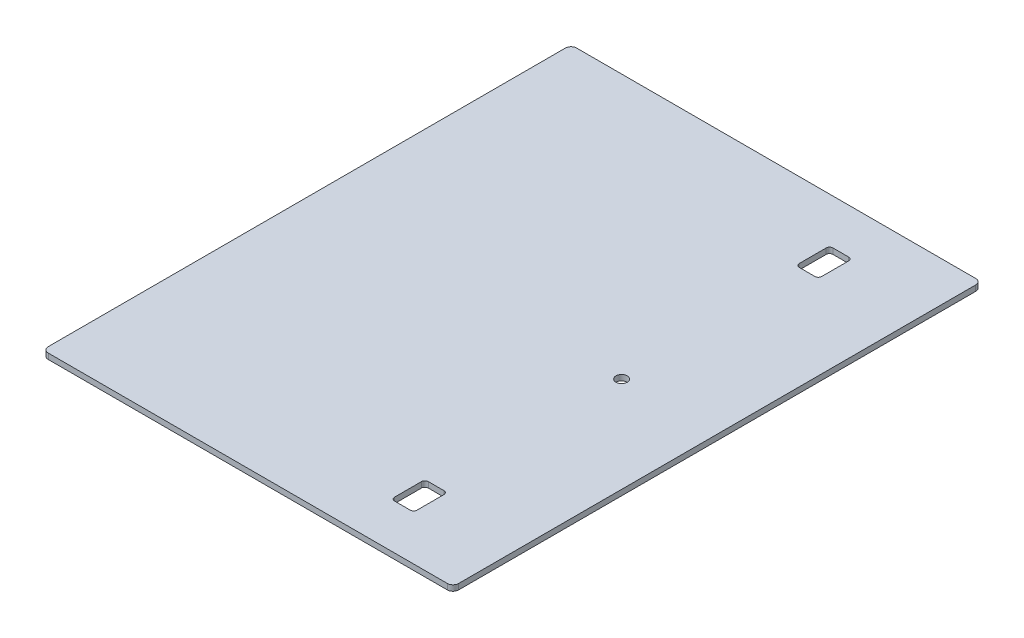
ISO-10303-21;
HEADER;
FILE_DESCRIPTION(('STEP AP214'),'2;1');
FILE_NAME('part.step','',(''),(''),'','','');
FILE_SCHEMA(('AUTOMOTIVE_DESIGN { 1 0 10303 214 1 1 1 1 }'));
ENDSEC;
DATA;
#1=APPLICATION_CONTEXT('core data for automotive mechanical design processes');
#2=APPLICATION_PROTOCOL_DEFINITION('international standard','automotive_design',2000,#1);
#3=PRODUCT_CONTEXT('',#1,'mechanical');
#4=PRODUCT('Part','Part','',(#3));
#5=PRODUCT_RELATED_PRODUCT_CATEGORY('part','',(#4));
#6=PRODUCT_DEFINITION_FORMATION('','',#4);
#7=PRODUCT_DEFINITION_CONTEXT('part definition',#1,'design');
#8=PRODUCT_DEFINITION('design','',#6,#7);
#9=PRODUCT_DEFINITION_SHAPE('','',#8);
#10=(LENGTH_UNIT() NAMED_UNIT(*) SI_UNIT(.MILLI.,.METRE.));
#11=(NAMED_UNIT(*) PLANE_ANGLE_UNIT() SI_UNIT($,.RADIAN.));
#12=(NAMED_UNIT(*) SI_UNIT($,.STERADIAN.) SOLID_ANGLE_UNIT());
#13=UNCERTAINTY_MEASURE_WITH_UNIT(LENGTH_MEASURE(1.E-05),#10,'distance_accuracy_value','');
#14=(GEOMETRIC_REPRESENTATION_CONTEXT(3) GLOBAL_UNCERTAINTY_ASSIGNED_CONTEXT((#13)) GLOBAL_UNIT_ASSIGNED_CONTEXT((#10,
#11,#12)) REPRESENTATION_CONTEXT('',''));
#15=CARTESIAN_POINT('',(0.,0.,0.));
#16=DIRECTION('',(0.,0.,1.));
#17=DIRECTION('',(1.,0.,0.));
#18=AXIS2_PLACEMENT_3D('',#15,#16,#17);
#19=CARTESIAN_POINT('',(115.8875,3.175,149.225));
#20=DIRECTION('',(-1.,0.,0.));
#21=DIRECTION('',(0.,0.,1.));
#22=AXIS2_PLACEMENT_3D('',#19,#20,#21);
#23=PLANE('',#22);
#24=DIRECTION('',(0.,0.,-1.));
#25=VECTOR('',#24,1.);
#26=CARTESIAN_POINT('',(115.8875,3.175,149.225));
#27=LINE('',#26,#25);
#28=CARTESIAN_POINT('',(115.8875,3.175,146.05));
#29=VERTEX_POINT('',#28);
#30=CARTESIAN_POINT('',(115.8875,3.175,-146.05));
#31=VERTEX_POINT('',#30);
#32=EDGE_CURVE('E251',#29,#31,#27,.T.);
#33=ORIENTED_EDGE('',*,*,#32,.F.);
#34=DIRECTION('',(0.,-1.,0.));
#35=VECTOR('',#34,1.);
#36=CARTESIAN_POINT('',(115.8875,3.175,146.05));
#37=LINE('',#36,#35);
#38=CARTESIAN_POINT('',(115.8875,0.,146.05));
#39=VERTEX_POINT('',#38);
#40=EDGE_CURVE('E293',#29,#39,#37,.T.);
#41=ORIENTED_EDGE('',*,*,#40,.T.);
#42=DIRECTION('',(0.,0.,-1.));
#43=VECTOR('',#42,1.);
#44=CARTESIAN_POINT('',(115.8875,0.,149.225));
#45=LINE('',#44,#43);
#46=CARTESIAN_POINT('',(115.8875,0.,-146.05));
#47=VERTEX_POINT('',#46);
#48=EDGE_CURVE('E461',#39,#47,#45,.T.);
#49=ORIENTED_EDGE('',*,*,#48,.T.);
#50=DIRECTION('',(0.,-1.,0.));
#51=VECTOR('',#50,1.);
#52=CARTESIAN_POINT('',(115.8875,3.175,-146.05));
#53=LINE('',#52,#51);
#54=EDGE_CURVE('E290',#47,#31,#53,.F.);
#55=ORIENTED_EDGE('',*,*,#54,.T.);
#56=EDGE_LOOP('',(#33,#41,#49,#55));
#57=FACE_BOUND('',#56,.T.);
#58=ADVANCED_FACE('F59',(#57),#23,.F.);
#59=CARTESIAN_POINT('',(-115.8875,3.175,-149.225));
#60=DIRECTION('',(0.,0.,1.));
#61=DIRECTION('',(1.,0.,0.));
#62=AXIS2_PLACEMENT_3D('',#59,#60,#61);
#63=PLANE('',#62);
#64=DIRECTION('',(-1.,0.,0.));
#65=VECTOR('',#64,1.);
#66=CARTESIAN_POINT('',(-115.8875,0.,-149.225));
#67=LINE('',#66,#65);
#68=CARTESIAN_POINT('',(112.7125,0.,-149.225));
#69=VERTEX_POINT('',#68);
#70=CARTESIAN_POINT('',(-112.7125,0.,-149.225));
#71=VERTEX_POINT('',#70);
#72=EDGE_CURVE('E260',#69,#71,#67,.T.);
#73=ORIENTED_EDGE('',*,*,#72,.T.);
#74=DIRECTION('',(0.,-1.,0.));
#75=VECTOR('',#74,1.);
#76=CARTESIAN_POINT('',(-112.7125,3.175,-149.225));
#77=LINE('',#76,#75);
#78=CARTESIAN_POINT('',(-112.7125,3.175,-149.225));
#79=VERTEX_POINT('',#78);
#80=EDGE_CURVE('E301',#71,#79,#77,.F.);
#81=ORIENTED_EDGE('',*,*,#80,.T.);
#82=DIRECTION('',(-1.,0.,0.));
#83=VECTOR('',#82,1.);
#84=CARTESIAN_POINT('',(-115.8875,3.175,-149.225));
#85=LINE('',#84,#83);
#86=CARTESIAN_POINT('',(112.7125,3.175,-149.225));
#87=VERTEX_POINT('',#86);
#88=EDGE_CURVE('E258',#87,#79,#85,.T.);
#89=ORIENTED_EDGE('',*,*,#88,.F.);
#90=DIRECTION('',(0.,-1.,0.));
#91=VECTOR('',#90,1.);
#92=CARTESIAN_POINT('',(112.7125,3.175,-149.225));
#93=LINE('',#92,#91);
#94=EDGE_CURVE('E297',#87,#69,#93,.T.);
#95=ORIENTED_EDGE('',*,*,#94,.T.);
#96=EDGE_LOOP('',(#73,#81,#89,#95));
#97=FACE_BOUND('',#96,.T.);
#98=ADVANCED_FACE('F480',(#97),#63,.F.);
#99=CARTESIAN_POINT('',(-115.8875,3.175,149.225));
#100=DIRECTION('',(1.,0.,0.));
#101=DIRECTION('',(0.,0.,-1.));
#102=AXIS2_PLACEMENT_3D('',#99,#100,#101);
#103=PLANE('',#102);
#104=DIRECTION('',(0.,0.,1.));
#105=VECTOR('',#104,1.);
#106=CARTESIAN_POINT('',(-115.8875,0.,149.225));
#107=LINE('',#106,#105);
#108=CARTESIAN_POINT('',(-115.8875,0.,-146.05));
#109=VERTEX_POINT('',#108);
#110=CARTESIAN_POINT('',(-115.8875,0.,146.05));
#111=VERTEX_POINT('',#110);
#112=EDGE_CURVE('E252',#109,#111,#107,.T.);
#113=ORIENTED_EDGE('',*,*,#112,.T.);
#114=DIRECTION('',(0.,-1.,0.));
#115=VECTOR('',#114,1.);
#116=CARTESIAN_POINT('',(-115.8875,3.175,146.05));
#117=LINE('',#116,#115);
#118=CARTESIAN_POINT('',(-115.8875,3.175,146.05));
#119=VERTEX_POINT('',#118);
#120=EDGE_CURVE('E227',#111,#119,#117,.F.);
#121=ORIENTED_EDGE('',*,*,#120,.T.);
#122=DIRECTION('',(0.,0.,1.));
#123=VECTOR('',#122,1.);
#124=CARTESIAN_POINT('',(-115.8875,3.175,149.225));
#125=LINE('',#124,#123);
#126=CARTESIAN_POINT('',(-115.8875,3.175,-146.05));
#127=VERTEX_POINT('',#126);
#128=EDGE_CURVE('E466',#127,#119,#125,.T.);
#129=ORIENTED_EDGE('',*,*,#128,.F.);
#130=DIRECTION('',(0.,-1.,0.));
#131=VECTOR('',#130,1.);
#132=CARTESIAN_POINT('',(-115.8875,3.175,-146.05));
#133=LINE('',#132,#131);
#134=EDGE_CURVE('E233',#127,#109,#133,.T.);
#135=ORIENTED_EDGE('',*,*,#134,.T.);
#136=EDGE_LOOP('',(#113,#121,#129,#135));
#137=FACE_BOUND('',#136,.T.);
#138=ADVANCED_FACE('F490',(#137),#103,.F.);
#139=CARTESIAN_POINT('',(-115.8875,3.175,149.225));
#140=DIRECTION('',(0.,0.,-1.));
#141=DIRECTION('',(-1.,0.,0.));
#142=AXIS2_PLACEMENT_3D('',#139,#140,#141);
#143=PLANE('',#142);
#144=DIRECTION('',(1.,0.,0.));
#145=VECTOR('',#144,1.);
#146=CARTESIAN_POINT('',(-115.8875,3.175,149.225));
#147=LINE('',#146,#145);
#148=CARTESIAN_POINT('',(-112.7125,3.175,149.225));
#149=VERTEX_POINT('',#148);
#150=CARTESIAN_POINT('',(112.7125,3.175,149.225));
#151=VERTEX_POINT('',#150);
#152=EDGE_CURVE('E243',#149,#151,#147,.T.);
#153=ORIENTED_EDGE('',*,*,#152,.F.);
#154=DIRECTION('',(0.,-1.,0.));
#155=VECTOR('',#154,1.);
#156=CARTESIAN_POINT('',(-112.7125,3.175,149.225));
#157=LINE('',#156,#155);
#158=CARTESIAN_POINT('',(-112.7125,0.,149.225));
#159=VERTEX_POINT('',#158);
#160=EDGE_CURVE('E226',#149,#159,#157,.T.);
#161=ORIENTED_EDGE('',*,*,#160,.T.);
#162=DIRECTION('',(1.,0.,0.));
#163=VECTOR('',#162,1.);
#164=CARTESIAN_POINT('',(-115.8875,0.,149.225));
#165=LINE('',#164,#163);
#166=CARTESIAN_POINT('',(112.7125,0.,149.225));
#167=VERTEX_POINT('',#166);
#168=EDGE_CURVE('E240',#159,#167,#165,.T.);
#169=ORIENTED_EDGE('',*,*,#168,.T.);
#170=DIRECTION('',(0.,-1.,0.));
#171=VECTOR('',#170,1.);
#172=CARTESIAN_POINT('',(112.7125,3.175,149.225));
#173=LINE('',#172,#171);
#174=EDGE_CURVE('E246',#167,#151,#173,.F.);
#175=ORIENTED_EDGE('',*,*,#174,.T.);
#176=EDGE_LOOP('',(#153,#161,#169,#175));
#177=FACE_BOUND('',#176,.T.);
#178=ADVANCED_FACE('F239',(#177),#143,.F.);
#179=CARTESIAN_POINT('',(0.,3.175,0.));
#180=DIRECTION('',(0.,-1.,0.));
#181=DIRECTION('',(0.,0.,-1.));
#182=AXIS2_PLACEMENT_3D('',#179,#180,#181);
#183=PLANE('',#182);
#184=DIRECTION('',(1.,0.,0.));
#185=VECTOR('',#184,1.);
#186=CARTESIAN_POINT('',(55.5624999999997,3.175,123.825));
#187=LINE('',#186,#185);
#188=CARTESIAN_POINT('',(57.4674999999997,3.175,123.825));
#189=VERTEX_POINT('',#188);
#190=CARTESIAN_POINT('',(66.3574999999997,3.175,123.825));
#191=VERTEX_POINT('',#190);
#192=EDGE_CURVE('E608',#189,#191,#187,.T.);
#193=ORIENTED_EDGE('',*,*,#192,.F.);
#194=CARTESIAN_POINT('',(57.4674999999997,3.175,121.92));
#195=DIRECTION('',(0.,-1.,0.));
#196=DIRECTION('',(0.,0.,-1.));
#197=AXIS2_PLACEMENT_3D('',#194,#195,#196);
#198=CIRCLE('',#197,1.905);
#199=CARTESIAN_POINT('',(55.5624999999997,3.175,121.92));
#200=VERTEX_POINT('',#199);
#201=EDGE_CURVE('E377',#189,#200,#198,.T.);
#202=ORIENTED_EDGE('',*,*,#201,.T.);
#203=DIRECTION('',(0.,0.,1.));
#204=VECTOR('',#203,1.);
#205=CARTESIAN_POINT('',(55.5624999999997,3.175,104.775));
#206=LINE('',#205,#204);
#207=CARTESIAN_POINT('',(55.5624999999997,3.175,106.68));
#208=VERTEX_POINT('',#207);
#209=EDGE_CURVE('E443',#208,#200,#206,.T.);
#210=ORIENTED_EDGE('',*,*,#209,.F.);
#211=CARTESIAN_POINT('',(57.4674999999997,3.175,106.68));
#212=DIRECTION('',(0.,-1.,0.));
#213=DIRECTION('',(0.,0.,-1.));
#214=AXIS2_PLACEMENT_3D('',#211,#212,#213);
#215=CIRCLE('',#214,1.905);
#216=CARTESIAN_POINT('',(57.4674999999997,3.175,104.775));
#217=VERTEX_POINT('',#216);
#218=EDGE_CURVE('E371',#208,#217,#215,.T.);
#219=ORIENTED_EDGE('',*,*,#218,.T.);
#220=DIRECTION('',(-1.,0.,0.));
#221=VECTOR('',#220,1.);
#222=CARTESIAN_POINT('',(55.5624999999997,3.175,104.775));
#223=LINE('',#222,#221);
#224=CARTESIAN_POINT('',(66.3574999999997,3.175,104.775));
#225=VERTEX_POINT('',#224);
#226=EDGE_CURVE('E436',#225,#217,#223,.T.);
#227=ORIENTED_EDGE('',*,*,#226,.F.);
#228=CARTESIAN_POINT('',(66.3574999999997,3.175,106.68));
#229=DIRECTION('',(0.,-1.,0.));
#230=DIRECTION('',(0.,0.,-1.));
#231=AXIS2_PLACEMENT_3D('',#228,#229,#230);
#232=CIRCLE('',#231,1.905);
#233=CARTESIAN_POINT('',(68.2624999999997,3.175,106.68));
#234=VERTEX_POINT('',#233);
#235=EDGE_CURVE('E365',#225,#234,#232,.T.);
#236=ORIENTED_EDGE('',*,*,#235,.T.);
#237=DIRECTION('',(0.,0.,-1.));
#238=VECTOR('',#237,1.);
#239=CARTESIAN_POINT('',(68.2624999999997,3.175,104.775));
#240=LINE('',#239,#238);
#241=CARTESIAN_POINT('',(68.2624999999997,3.175,121.92));
#242=VERTEX_POINT('',#241);
#243=EDGE_CURVE('E613',#242,#234,#240,.T.);
#244=ORIENTED_EDGE('',*,*,#243,.F.);
#245=CARTESIAN_POINT('',(66.3574999999997,3.175,121.92));
#246=DIRECTION('',(0.,-1.,0.));
#247=DIRECTION('',(0.,0.,-1.));
#248=AXIS2_PLACEMENT_3D('',#245,#246,#247);
#249=CIRCLE('',#248,1.905);
#250=EDGE_CURVE('E359',#242,#191,#249,.T.);
#251=ORIENTED_EDGE('',*,*,#250,.T.);
#252=EDGE_LOOP('',(#193,#202,#210,#219,#227,#236,#244,#251));
#253=FACE_BOUND('',#252,.T.);
#254=DIRECTION('',(1.,0.,0.));
#255=VECTOR('',#254,1.);
#256=CARTESIAN_POINT('',(55.5624999999997,3.175,-104.775));
#257=LINE('',#256,#255);
#258=CARTESIAN_POINT('',(57.4674999999997,3.175,-104.775));
#259=VERTEX_POINT('',#258);
#260=CARTESIAN_POINT('',(66.3574999999997,3.175,-104.775));
#261=VERTEX_POINT('',#260);
#262=EDGE_CURVE('E446',#259,#261,#257,.T.);
#263=ORIENTED_EDGE('',*,*,#262,.F.);
#264=CARTESIAN_POINT('',(57.4674999999997,3.175,-106.68));
#265=DIRECTION('',(0.,-1.,0.));
#266=DIRECTION('',(0.,0.,-1.));
#267=AXIS2_PLACEMENT_3D('',#264,#265,#266);
#268=CIRCLE('',#267,1.905);
#269=CARTESIAN_POINT('',(55.5624999999997,3.175,-106.68));
#270=VERTEX_POINT('',#269);
#271=EDGE_CURVE('E383',#259,#270,#268,.T.);
#272=ORIENTED_EDGE('',*,*,#271,.T.);
#273=DIRECTION('',(0.,0.,1.));
#274=VECTOR('',#273,1.);
#275=CARTESIAN_POINT('',(55.5624999999997,3.175,-123.825));
#276=LINE('',#275,#274);
#277=CARTESIAN_POINT('',(55.5624999999997,3.175,-121.92));
#278=VERTEX_POINT('',#277);
#279=EDGE_CURVE('E409',#278,#270,#276,.T.);
#280=ORIENTED_EDGE('',*,*,#279,.F.);
#281=CARTESIAN_POINT('',(57.4674999999997,3.175,-121.92));
#282=DIRECTION('',(0.,-1.,0.));
#283=DIRECTION('',(0.,0.,-1.));
#284=AXIS2_PLACEMENT_3D('',#281,#282,#283);
#285=CIRCLE('',#284,1.905);
#286=CARTESIAN_POINT('',(57.4674999999997,3.175,-123.825));
#287=VERTEX_POINT('',#286);
#288=EDGE_CURVE('E68',#278,#287,#285,.T.);
#289=ORIENTED_EDGE('',*,*,#288,.T.);
#290=DIRECTION('',(-1.,0.,0.));
#291=VECTOR('',#290,1.);
#292=CARTESIAN_POINT('',(55.5624999999997,3.175,-123.825));
#293=LINE('',#292,#291);
#294=CARTESIAN_POINT('',(66.3574999999997,3.175,-123.825));
#295=VERTEX_POINT('',#294);
#296=EDGE_CURVE('E407',#295,#287,#293,.T.);
#297=ORIENTED_EDGE('',*,*,#296,.F.);
#298=CARTESIAN_POINT('',(66.3574999999997,3.175,-121.92));
#299=DIRECTION('',(0.,-1.,0.));
#300=DIRECTION('',(0.,0.,-1.));
#301=AXIS2_PLACEMENT_3D('',#298,#299,#300);
#302=CIRCLE('',#301,1.905);
#303=CARTESIAN_POINT('',(68.2624999999997,3.175,-121.92));
#304=VERTEX_POINT('',#303);
#305=EDGE_CURVE('E395',#295,#304,#302,.T.);
#306=ORIENTED_EDGE('',*,*,#305,.T.);
#307=DIRECTION('',(0.,0.,-1.));
#308=VECTOR('',#307,1.);
#309=CARTESIAN_POINT('',(68.2624999999997,3.175,-123.825));
#310=LINE('',#309,#308);
#311=CARTESIAN_POINT('',(68.2624999999997,3.175,-106.68));
#312=VERTEX_POINT('',#311);
#313=EDGE_CURVE('E416',#312,#304,#310,.T.);
#314=ORIENTED_EDGE('',*,*,#313,.F.);
#315=CARTESIAN_POINT('',(66.3574999999997,3.175,-106.68));
#316=DIRECTION('',(0.,-1.,0.));
#317=DIRECTION('',(0.,0.,-1.));
#318=AXIS2_PLACEMENT_3D('',#315,#316,#317);
#319=CIRCLE('',#318,1.905);
#320=EDGE_CURVE('E389',#312,#261,#319,.T.);
#321=ORIENTED_EDGE('',*,*,#320,.T.);
#322=EDGE_LOOP('',(#263,#272,#280,#289,#297,#306,#314,#321));
#323=FACE_BOUND('',#322,.T.);
#324=CARTESIAN_POINT('',(61.9124999999997,3.175,0.));
#325=DIRECTION('',(0.,1.,0.));
#326=DIRECTION('',(0.,0.,1.));
#327=AXIS2_PLACEMENT_3D('',#324,#325,#326);
#328=CIRCLE('',#327,3.17499999999998);
#329=CARTESIAN_POINT('',(61.9124999999997,3.175,3.17499999999998));
#330=VERTEX_POINT('',#329);
#331=EDGE_CURVE('E453',#330,#330,#328,.T.);
#332=ORIENTED_EDGE('',*,*,#331,.F.);
#333=EDGE_LOOP('',(#332));
#334=FACE_BOUND('',#333,.T.);
#335=ORIENTED_EDGE('',*,*,#128,.T.);
#336=CARTESIAN_POINT('',(-112.7125,3.175,146.05));
#337=DIRECTION('',(0.,-1.,0.));
#338=DIRECTION('',(0.,0.,-1.));
#339=AXIS2_PLACEMENT_3D('',#336,#337,#338);
#340=CIRCLE('',#339,3.175);
#341=EDGE_CURVE('E287',#119,#149,#340,.F.);
#342=ORIENTED_EDGE('',*,*,#341,.T.);
#343=ORIENTED_EDGE('',*,*,#152,.T.);
#344=CARTESIAN_POINT('',(112.7125,3.175,146.05));
#345=DIRECTION('',(0.,-1.,0.));
#346=DIRECTION('',(0.,0.,-1.));
#347=AXIS2_PLACEMENT_3D('',#344,#345,#346);
#348=CIRCLE('',#347,3.175);
#349=EDGE_CURVE('E284',#151,#29,#348,.F.);
#350=ORIENTED_EDGE('',*,*,#349,.T.);
#351=ORIENTED_EDGE('',*,*,#32,.T.);
#352=CARTESIAN_POINT('',(112.7125,3.175,-146.05));
#353=DIRECTION('',(0.,-1.,0.));
#354=DIRECTION('',(0.,0.,-1.));
#355=AXIS2_PLACEMENT_3D('',#352,#353,#354);
#356=CIRCLE('',#355,3.175);
#357=EDGE_CURVE('E278',#31,#87,#356,.F.);
#358=ORIENTED_EDGE('',*,*,#357,.T.);
#359=ORIENTED_EDGE('',*,*,#88,.T.);
#360=CARTESIAN_POINT('',(-112.7125,3.175,-146.05));
#361=DIRECTION('',(0.,-1.,0.));
#362=DIRECTION('',(0.,0.,-1.));
#363=AXIS2_PLACEMENT_3D('',#360,#361,#362);
#364=CIRCLE('',#363,3.175);
#365=EDGE_CURVE('E281',#79,#127,#364,.F.);
#366=ORIENTED_EDGE('',*,*,#365,.T.);
#367=EDGE_LOOP('',(#335,#342,#343,#350,#351,#358,#359,#366));
#368=FACE_BOUND('',#367,.T.);
#369=ADVANCED_FACE('F405',(#253,#323,#334,#368),#183,.F.);
#370=CARTESIAN_POINT('',(0.,0.,0.));
#371=DIRECTION('',(0.,-1.,0.));
#372=DIRECTION('',(0.,0.,-1.));
#373=AXIS2_PLACEMENT_3D('',#370,#371,#372);
#374=PLANE('',#373);
#375=DIRECTION('',(-1.,0.,0.));
#376=VECTOR('',#375,1.);
#377=CARTESIAN_POINT('',(55.5624999999997,0.,104.775));
#378=LINE('',#377,#376);
#379=CARTESIAN_POINT('',(66.3574999999997,0.,104.775));
#380=VERTEX_POINT('',#379);
#381=CARTESIAN_POINT('',(57.4674999999997,0.,104.775));
#382=VERTEX_POINT('',#381);
#383=EDGE_CURVE('E458',#380,#382,#378,.T.);
#384=ORIENTED_EDGE('',*,*,#383,.T.);
#385=CARTESIAN_POINT('',(57.4674999999997,0.,106.68));
#386=DIRECTION('',(0.,-1.,0.));
#387=DIRECTION('',(0.,0.,-1.));
#388=AXIS2_PLACEMENT_3D('',#385,#386,#387);
#389=CIRCLE('',#388,1.905);
#390=CARTESIAN_POINT('',(55.5624999999997,0.,106.68));
#391=VERTEX_POINT('',#390);
#392=EDGE_CURVE('E374',#382,#391,#389,.F.);
#393=ORIENTED_EDGE('',*,*,#392,.T.);
#394=DIRECTION('',(0.,0.,1.));
#395=VECTOR('',#394,1.);
#396=CARTESIAN_POINT('',(55.5624999999997,0.,104.775));
#397=LINE('',#396,#395);
#398=CARTESIAN_POINT('',(55.5624999999997,0.,121.92));
#399=VERTEX_POINT('',#398);
#400=EDGE_CURVE('E603',#391,#399,#397,.T.);
#401=ORIENTED_EDGE('',*,*,#400,.T.);
#402=CARTESIAN_POINT('',(57.4674999999997,0.,121.92));
#403=DIRECTION('',(0.,-1.,0.));
#404=DIRECTION('',(0.,0.,-1.));
#405=AXIS2_PLACEMENT_3D('',#402,#403,#404);
#406=CIRCLE('',#405,1.905);
#407=CARTESIAN_POINT('',(57.4674999999997,0.,123.825));
#408=VERTEX_POINT('',#407);
#409=EDGE_CURVE('E380',#399,#408,#406,.F.);
#410=ORIENTED_EDGE('',*,*,#409,.T.);
#411=DIRECTION('',(1.,0.,0.));
#412=VECTOR('',#411,1.);
#413=CARTESIAN_POINT('',(55.5624999999997,0.,123.825));
#414=LINE('',#413,#412);
#415=CARTESIAN_POINT('',(66.3574999999997,0.,123.825));
#416=VERTEX_POINT('',#415);
#417=EDGE_CURVE('E625',#408,#416,#414,.T.);
#418=ORIENTED_EDGE('',*,*,#417,.T.);
#419=CARTESIAN_POINT('',(66.3574999999997,0.,121.92));
#420=DIRECTION('',(0.,-1.,0.));
#421=DIRECTION('',(0.,0.,-1.));
#422=AXIS2_PLACEMENT_3D('',#419,#420,#421);
#423=CIRCLE('',#422,1.905);
#424=CARTESIAN_POINT('',(68.2624999999997,0.,121.92));
#425=VERTEX_POINT('',#424);
#426=EDGE_CURVE('E362',#416,#425,#423,.F.);
#427=ORIENTED_EDGE('',*,*,#426,.T.);
#428=DIRECTION('',(0.,0.,-1.));
#429=VECTOR('',#428,1.);
#430=CARTESIAN_POINT('',(68.2624999999997,0.,104.775));
#431=LINE('',#430,#429);
#432=CARTESIAN_POINT('',(68.2624999999997,0.,106.68));
#433=VERTEX_POINT('',#432);
#434=EDGE_CURVE('E596',#425,#433,#431,.T.);
#435=ORIENTED_EDGE('',*,*,#434,.T.);
#436=CARTESIAN_POINT('',(66.3574999999997,0.,106.68));
#437=DIRECTION('',(0.,-1.,0.));
#438=DIRECTION('',(0.,0.,-1.));
#439=AXIS2_PLACEMENT_3D('',#436,#437,#438);
#440=CIRCLE('',#439,1.905);
#441=EDGE_CURVE('E368',#433,#380,#440,.F.);
#442=ORIENTED_EDGE('',*,*,#441,.T.);
#443=EDGE_LOOP('',(#384,#393,#401,#410,#418,#427,#435,#442));
#444=FACE_BOUND('',#443,.T.);
#445=DIRECTION('',(-1.,0.,0.));
#446=VECTOR('',#445,1.);
#447=CARTESIAN_POINT('',(55.5624999999997,0.,-123.825));
#448=LINE('',#447,#446);
#449=CARTESIAN_POINT('',(66.3574999999997,0.,-123.825));
#450=VERTEX_POINT('',#449);
#451=CARTESIAN_POINT('',(57.4674999999997,0.,-123.825));
#452=VERTEX_POINT('',#451);
#453=EDGE_CURVE('E423',#450,#452,#448,.T.);
#454=ORIENTED_EDGE('',*,*,#453,.T.);
#455=CARTESIAN_POINT('',(57.4674999999997,0.,-121.92));
#456=DIRECTION('',(0.,-1.,0.));
#457=DIRECTION('',(0.,0.,-1.));
#458=AXIS2_PLACEMENT_3D('',#455,#456,#457);
#459=CIRCLE('',#458,1.905);
#460=CARTESIAN_POINT('',(55.5624999999997,0.,-121.92));
#461=VERTEX_POINT('',#460);
#462=EDGE_CURVE('E12',#452,#461,#459,.F.);
#463=ORIENTED_EDGE('',*,*,#462,.T.);
#464=DIRECTION('',(0.,0.,1.));
#465=VECTOR('',#464,1.);
#466=CARTESIAN_POINT('',(55.5624999999997,0.,-123.825));
#467=LINE('',#466,#465);
#468=CARTESIAN_POINT('',(55.5624999999997,0.,-106.68));
#469=VERTEX_POINT('',#468);
#470=EDGE_CURVE('E415',#461,#469,#467,.T.);
#471=ORIENTED_EDGE('',*,*,#470,.T.);
#472=CARTESIAN_POINT('',(57.4674999999997,0.,-106.68));
#473=DIRECTION('',(0.,-1.,0.));
#474=DIRECTION('',(0.,0.,-1.));
#475=AXIS2_PLACEMENT_3D('',#472,#473,#474);
#476=CIRCLE('',#475,1.905);
#477=CARTESIAN_POINT('',(57.4674999999997,0.,-104.775));
#478=VERTEX_POINT('',#477);
#479=EDGE_CURVE('E386',#469,#478,#476,.F.);
#480=ORIENTED_EDGE('',*,*,#479,.T.);
#481=DIRECTION('',(1.,0.,0.));
#482=VECTOR('',#481,1.);
#483=CARTESIAN_POINT('',(55.5624999999997,0.,-104.775));
#484=LINE('',#483,#482);
#485=CARTESIAN_POINT('',(66.3574999999997,0.,-104.775));
#486=VERTEX_POINT('',#485);
#487=EDGE_CURVE('E428',#478,#486,#484,.T.);
#488=ORIENTED_EDGE('',*,*,#487,.T.);
#489=CARTESIAN_POINT('',(66.3574999999997,0.,-106.68));
#490=DIRECTION('',(0.,-1.,0.));
#491=DIRECTION('',(0.,0.,-1.));
#492=AXIS2_PLACEMENT_3D('',#489,#490,#491);
#493=CIRCLE('',#492,1.905);
#494=CARTESIAN_POINT('',(68.2624999999997,0.,-106.68));
#495=VERTEX_POINT('',#494);
#496=EDGE_CURVE('E392',#486,#495,#493,.F.);
#497=ORIENTED_EDGE('',*,*,#496,.T.);
#498=DIRECTION('',(0.,0.,-1.));
#499=VECTOR('',#498,1.);
#500=CARTESIAN_POINT('',(68.2624999999997,0.,-123.825));
#501=LINE('',#500,#499);
#502=CARTESIAN_POINT('',(68.2624999999997,0.,-121.92));
#503=VERTEX_POINT('',#502);
#504=EDGE_CURVE('E433',#495,#503,#501,.T.);
#505=ORIENTED_EDGE('',*,*,#504,.T.);
#506=CARTESIAN_POINT('',(66.3574999999997,0.,-121.92));
#507=DIRECTION('',(0.,-1.,0.));
#508=DIRECTION('',(0.,0.,-1.));
#509=AXIS2_PLACEMENT_3D('',#506,#507,#508);
#510=CIRCLE('',#509,1.905);
#511=EDGE_CURVE('E82',#503,#450,#510,.F.);
#512=ORIENTED_EDGE('',*,*,#511,.T.);
#513=EDGE_LOOP('',(#454,#463,#471,#480,#488,#497,#505,#512));
#514=FACE_BOUND('',#513,.T.);
#515=CARTESIAN_POINT('',(61.9124999999997,0.,0.));
#516=DIRECTION('',(0.,1.,0.));
#517=DIRECTION('',(0.,0.,1.));
#518=AXIS2_PLACEMENT_3D('',#515,#516,#517);
#519=CIRCLE('',#518,3.175);
#520=CARTESIAN_POINT('',(61.9124999999997,0.,3.175));
#521=VERTEX_POINT('',#520);
#522=EDGE_CURVE('E457',#521,#521,#519,.T.);
#523=ORIENTED_EDGE('',*,*,#522,.T.);
#524=EDGE_LOOP('',(#523));
#525=FACE_BOUND('',#524,.T.);
#526=ORIENTED_EDGE('',*,*,#168,.F.);
#527=CARTESIAN_POINT('',(-112.7125,0.,146.05));
#528=DIRECTION('',(0.,-1.,0.));
#529=DIRECTION('',(0.,0.,-1.));
#530=AXIS2_PLACEMENT_3D('',#527,#528,#529);
#531=CIRCLE('',#530,3.175);
#532=EDGE_CURVE('E222',#159,#111,#531,.T.);
#533=ORIENTED_EDGE('',*,*,#532,.T.);
#534=ORIENTED_EDGE('',*,*,#112,.F.);
#535=CARTESIAN_POINT('',(-112.7125,0.,-146.05));
#536=DIRECTION('',(0.,-1.,0.));
#537=DIRECTION('',(0.,0.,-1.));
#538=AXIS2_PLACEMENT_3D('',#535,#536,#537);
#539=CIRCLE('',#538,3.175);
#540=EDGE_CURVE('E268',#109,#71,#539,.T.);
#541=ORIENTED_EDGE('',*,*,#540,.T.);
#542=ORIENTED_EDGE('',*,*,#72,.F.);
#543=CARTESIAN_POINT('',(112.7125,0.,-146.05));
#544=DIRECTION('',(0.,-1.,0.));
#545=DIRECTION('',(0.,0.,-1.));
#546=AXIS2_PLACEMENT_3D('',#543,#544,#545);
#547=CIRCLE('',#546,3.175);
#548=EDGE_CURVE('E245',#69,#47,#547,.T.);
#549=ORIENTED_EDGE('',*,*,#548,.T.);
#550=ORIENTED_EDGE('',*,*,#48,.F.);
#551=CARTESIAN_POINT('',(112.7125,0.,146.05));
#552=DIRECTION('',(0.,-1.,0.));
#553=DIRECTION('',(0.,0.,-1.));
#554=AXIS2_PLACEMENT_3D('',#551,#552,#553);
#555=CIRCLE('',#554,3.175);
#556=EDGE_CURVE('E234',#39,#167,#555,.T.);
#557=ORIENTED_EDGE('',*,*,#556,.T.);
#558=EDGE_LOOP('',(#526,#533,#534,#541,#542,#549,#550,#557));
#559=FACE_BOUND('',#558,.T.);
#560=ADVANCED_FACE('F248',(#444,#514,#525,#559),#374,.T.);
#561=CARTESIAN_POINT('',(61.9124999999997,3.175,0.));
#562=DIRECTION('',(0.,1.,0.));
#563=DIRECTION('',(0.,0.,1.));
#564=AXIS2_PLACEMENT_3D('',#561,#562,#563);
#565=CYLINDRICAL_SURFACE('',#564,3.17499999999999);
#566=ORIENTED_EDGE('',*,*,#522,.F.);
#567=EDGE_LOOP('',(#566));
#568=FACE_BOUND('',#567,.T.);
#569=ORIENTED_EDGE('',*,*,#331,.T.);
#570=EDGE_LOOP('',(#569));
#571=FACE_BOUND('',#570,.T.);
#572=ADVANCED_FACE('F509',(#568,#571),#565,.F.);
#573=CARTESIAN_POINT('',(-112.7125,3.175,146.05));
#574=DIRECTION('',(0.,-1.,0.));
#575=DIRECTION('',(0.,0.,-1.));
#576=AXIS2_PLACEMENT_3D('',#573,#574,#575);
#577=CYLINDRICAL_SURFACE('',#576,3.175);
#578=ORIENTED_EDGE('',*,*,#341,.F.);
#579=ORIENTED_EDGE('',*,*,#120,.F.);
#580=ORIENTED_EDGE('',*,*,#532,.F.);
#581=ORIENTED_EDGE('',*,*,#160,.F.);
#582=EDGE_LOOP('',(#578,#579,#580,#581));
#583=FACE_BOUND('',#582,.T.);
#584=ADVANCED_FACE('F225',(#583),#577,.T.);
#585=CARTESIAN_POINT('',(112.7125,3.175,146.05));
#586=DIRECTION('',(0.,-1.,0.));
#587=DIRECTION('',(0.,0.,-1.));
#588=AXIS2_PLACEMENT_3D('',#585,#586,#587);
#589=CYLINDRICAL_SURFACE('',#588,3.175);
#590=ORIENTED_EDGE('',*,*,#349,.F.);
#591=ORIENTED_EDGE('',*,*,#174,.F.);
#592=ORIENTED_EDGE('',*,*,#556,.F.);
#593=ORIENTED_EDGE('',*,*,#40,.F.);
#594=EDGE_LOOP('',(#590,#591,#592,#593));
#595=FACE_BOUND('',#594,.T.);
#596=ADVANCED_FACE('F508',(#595),#589,.T.);
#597=CARTESIAN_POINT('',(-112.7125,3.175,-146.05));
#598=DIRECTION('',(0.,-1.,0.));
#599=DIRECTION('',(0.,0.,-1.));
#600=AXIS2_PLACEMENT_3D('',#597,#598,#599);
#601=CYLINDRICAL_SURFACE('',#600,3.175);
#602=ORIENTED_EDGE('',*,*,#365,.F.);
#603=ORIENTED_EDGE('',*,*,#80,.F.);
#604=ORIENTED_EDGE('',*,*,#540,.F.);
#605=ORIENTED_EDGE('',*,*,#134,.F.);
#606=EDGE_LOOP('',(#602,#603,#604,#605));
#607=FACE_BOUND('',#606,.T.);
#608=ADVANCED_FACE('F485',(#607),#601,.T.);
#609=CARTESIAN_POINT('',(112.7125,3.175,-146.05));
#610=DIRECTION('',(0.,-1.,0.));
#611=DIRECTION('',(0.,0.,-1.));
#612=AXIS2_PLACEMENT_3D('',#609,#610,#611);
#613=CYLINDRICAL_SURFACE('',#612,3.175);
#614=ORIENTED_EDGE('',*,*,#357,.F.);
#615=ORIENTED_EDGE('',*,*,#54,.F.);
#616=ORIENTED_EDGE('',*,*,#548,.F.);
#617=ORIENTED_EDGE('',*,*,#94,.F.);
#618=EDGE_LOOP('',(#614,#615,#616,#617));
#619=FACE_BOUND('',#618,.T.);
#620=ADVANCED_FACE('F515',(#619),#613,.T.);
#621=CARTESIAN_POINT('',(55.5624999999997,0.,-123.825));
#622=DIRECTION('',(-1.,0.,0.));
#623=DIRECTION('',(0.,0.,1.));
#624=AXIS2_PLACEMENT_3D('',#621,#622,#623);
#625=PLANE('',#624);
#626=ORIENTED_EDGE('',*,*,#279,.T.);
#627=DIRECTION('',(0.,1.,0.));
#628=VECTOR('',#627,1.);
#629=CARTESIAN_POINT('',(55.5624999999997,0.,-106.68));
#630=LINE('',#629,#628);
#631=EDGE_CURVE('E343',#270,#469,#630,.F.);
#632=ORIENTED_EDGE('',*,*,#631,.T.);
#633=ORIENTED_EDGE('',*,*,#470,.F.);
#634=DIRECTION('',(0.,1.,0.));
#635=VECTOR('',#634,1.);
#636=CARTESIAN_POINT('',(55.5624999999997,3.175,-121.92));
#637=LINE('',#636,#635);
#638=EDGE_CURVE('E339',#461,#278,#637,.T.);
#639=ORIENTED_EDGE('',*,*,#638,.T.);
#640=EDGE_LOOP('',(#626,#632,#633,#639));
#641=FACE_BOUND('',#640,.T.);
#642=ADVANCED_FACE('F425',(#641),#625,.F.);
#643=CARTESIAN_POINT('',(55.5624999999997,0.,-123.825));
#644=DIRECTION('',(0.,0.,-1.));
#645=DIRECTION('',(-1.,0.,0.));
#646=AXIS2_PLACEMENT_3D('',#643,#644,#645);
#647=PLANE('',#646);
#648=ORIENTED_EDGE('',*,*,#453,.F.);
#649=DIRECTION('',(0.,1.,0.));
#650=VECTOR('',#649,1.);
#651=CARTESIAN_POINT('',(66.3574999999997,3.175,-123.825));
#652=LINE('',#651,#650);
#653=EDGE_CURVE('E355',#450,#295,#652,.T.);
#654=ORIENTED_EDGE('',*,*,#653,.T.);
#655=ORIENTED_EDGE('',*,*,#296,.T.);
#656=DIRECTION('',(0.,1.,0.));
#657=VECTOR('',#656,1.);
#658=CARTESIAN_POINT('',(57.4674999999997,0.,-123.825));
#659=LINE('',#658,#657);
#660=EDGE_CURVE('E75',#287,#452,#659,.F.);
#661=ORIENTED_EDGE('',*,*,#660,.T.);
#662=EDGE_LOOP('',(#648,#654,#655,#661));
#663=FACE_BOUND('',#662,.T.);
#664=ADVANCED_FACE('F412',(#663),#647,.F.);
#665=CARTESIAN_POINT('',(68.2624999999997,0.,-123.825));
#666=DIRECTION('',(1.,0.,0.));
#667=DIRECTION('',(0.,0.,-1.));
#668=AXIS2_PLACEMENT_3D('',#665,#666,#667);
#669=PLANE('',#668);
#670=ORIENTED_EDGE('',*,*,#504,.F.);
#671=DIRECTION('',(0.,1.,0.));
#672=VECTOR('',#671,1.);
#673=CARTESIAN_POINT('',(68.2624999999997,3.175,-106.68));
#674=LINE('',#673,#672);
#675=EDGE_CURVE('E349',#495,#312,#674,.T.);
#676=ORIENTED_EDGE('',*,*,#675,.T.);
#677=ORIENTED_EDGE('',*,*,#313,.T.);
#678=DIRECTION('',(0.,1.,0.));
#679=VECTOR('',#678,1.);
#680=CARTESIAN_POINT('',(68.2624999999997,0.,-121.92));
#681=LINE('',#680,#679);
#682=EDGE_CURVE('E346',#304,#503,#681,.F.);
#683=ORIENTED_EDGE('',*,*,#682,.T.);
#684=EDGE_LOOP('',(#670,#676,#677,#683));
#685=FACE_BOUND('',#684,.T.);
#686=ADVANCED_FACE('F553',(#685),#669,.F.);
#687=CARTESIAN_POINT('',(55.5624999999997,0.,-104.775));
#688=DIRECTION('',(0.,0.,1.));
#689=DIRECTION('',(1.,0.,0.));
#690=AXIS2_PLACEMENT_3D('',#687,#688,#689);
#691=PLANE('',#690);
#692=ORIENTED_EDGE('',*,*,#487,.F.);
#693=DIRECTION('',(0.,1.,0.));
#694=VECTOR('',#693,1.);
#695=CARTESIAN_POINT('',(57.4674999999997,3.175,-104.775));
#696=LINE('',#695,#694);
#697=EDGE_CURVE('E335',#478,#259,#696,.T.);
#698=ORIENTED_EDGE('',*,*,#697,.T.);
#699=ORIENTED_EDGE('',*,*,#262,.T.);
#700=DIRECTION('',(0.,1.,0.));
#701=VECTOR('',#700,1.);
#702=CARTESIAN_POINT('',(66.3574999999997,0.,-104.775));
#703=LINE('',#702,#701);
#704=EDGE_CURVE('E332',#261,#486,#703,.F.);
#705=ORIENTED_EDGE('',*,*,#704,.T.);
#706=EDGE_LOOP('',(#692,#698,#699,#705));
#707=FACE_BOUND('',#706,.T.);
#708=ADVANCED_FACE('F559',(#707),#691,.F.);
#709=CARTESIAN_POINT('',(55.5624999999997,0.,104.775));
#710=DIRECTION('',(-1.,0.,0.));
#711=DIRECTION('',(0.,0.,1.));
#712=AXIS2_PLACEMENT_3D('',#709,#710,#711);
#713=PLANE('',#712);
#714=ORIENTED_EDGE('',*,*,#400,.F.);
#715=DIRECTION('',(0.,1.,0.));
#716=VECTOR('',#715,1.);
#717=CARTESIAN_POINT('',(55.5624999999997,3.175,106.68));
#718=LINE('',#717,#716);
#719=EDGE_CURVE('E328',#391,#208,#718,.T.);
#720=ORIENTED_EDGE('',*,*,#719,.T.);
#721=ORIENTED_EDGE('',*,*,#209,.T.);
#722=DIRECTION('',(0.,1.,0.));
#723=VECTOR('',#722,1.);
#724=CARTESIAN_POINT('',(55.5624999999997,0.,121.92));
#725=LINE('',#724,#723);
#726=EDGE_CURVE('E325',#200,#399,#725,.F.);
#727=ORIENTED_EDGE('',*,*,#726,.T.);
#728=EDGE_LOOP('',(#714,#720,#721,#727));
#729=FACE_BOUND('',#728,.T.);
#730=ADVANCED_FACE('F562',(#729),#713,.F.);
#731=CARTESIAN_POINT('',(55.5624999999997,0.,104.775));
#732=DIRECTION('',(0.,0.,-1.));
#733=DIRECTION('',(-1.,0.,0.));
#734=AXIS2_PLACEMENT_3D('',#731,#732,#733);
#735=PLANE('',#734);
#736=ORIENTED_EDGE('',*,*,#383,.F.);
#737=DIRECTION('',(0.,1.,0.));
#738=VECTOR('',#737,1.);
#739=CARTESIAN_POINT('',(66.3574999999997,3.175,104.775));
#740=LINE('',#739,#738);
#741=EDGE_CURVE('E321',#380,#225,#740,.T.);
#742=ORIENTED_EDGE('',*,*,#741,.T.);
#743=ORIENTED_EDGE('',*,*,#226,.T.);
#744=DIRECTION('',(0.,1.,0.));
#745=VECTOR('',#744,1.);
#746=CARTESIAN_POINT('',(57.4674999999997,0.,104.775));
#747=LINE('',#746,#745);
#748=EDGE_CURVE('E318',#217,#382,#747,.F.);
#749=ORIENTED_EDGE('',*,*,#748,.T.);
#750=EDGE_LOOP('',(#736,#742,#743,#749));
#751=FACE_BOUND('',#750,.T.);
#752=ADVANCED_FACE('F568',(#751),#735,.F.);
#753=CARTESIAN_POINT('',(68.2624999999997,0.,104.775));
#754=DIRECTION('',(1.,0.,0.));
#755=DIRECTION('',(0.,0.,-1.));
#756=AXIS2_PLACEMENT_3D('',#753,#754,#755);
#757=PLANE('',#756);
#758=ORIENTED_EDGE('',*,*,#434,.F.);
#759=DIRECTION('',(0.,1.,0.));
#760=VECTOR('',#759,1.);
#761=CARTESIAN_POINT('',(68.2624999999997,3.175,121.92));
#762=LINE('',#761,#760);
#763=EDGE_CURVE('E307',#425,#242,#762,.T.);
#764=ORIENTED_EDGE('',*,*,#763,.T.);
#765=ORIENTED_EDGE('',*,*,#243,.T.);
#766=DIRECTION('',(0.,1.,0.));
#767=VECTOR('',#766,1.);
#768=CARTESIAN_POINT('',(68.2624999999997,0.,106.68));
#769=LINE('',#768,#767);
#770=EDGE_CURVE('E304',#234,#433,#769,.F.);
#771=ORIENTED_EDGE('',*,*,#770,.T.);
#772=EDGE_LOOP('',(#758,#764,#765,#771));
#773=FACE_BOUND('',#772,.T.);
#774=ADVANCED_FACE('F641',(#773),#757,.F.);
#775=CARTESIAN_POINT('',(55.5624999999997,0.,123.825));
#776=DIRECTION('',(0.,0.,1.));
#777=DIRECTION('',(1.,0.,0.));
#778=AXIS2_PLACEMENT_3D('',#775,#776,#777);
#779=PLANE('',#778);
#780=ORIENTED_EDGE('',*,*,#192,.T.);
#781=DIRECTION('',(0.,1.,0.));
#782=VECTOR('',#781,1.);
#783=CARTESIAN_POINT('',(66.3574999999997,0.,123.825));
#784=LINE('',#783,#782);
#785=EDGE_CURVE('E315',#191,#416,#784,.F.);
#786=ORIENTED_EDGE('',*,*,#785,.T.);
#787=ORIENTED_EDGE('',*,*,#417,.F.);
#788=DIRECTION('',(0.,1.,0.));
#789=VECTOR('',#788,1.);
#790=CARTESIAN_POINT('',(57.4674999999997,3.175,123.825));
#791=LINE('',#790,#789);
#792=EDGE_CURVE('E311',#408,#189,#791,.T.);
#793=ORIENTED_EDGE('',*,*,#792,.T.);
#794=EDGE_LOOP('',(#780,#786,#787,#793));
#795=FACE_BOUND('',#794,.T.);
#796=ADVANCED_FACE('F523',(#795),#779,.F.);
#797=CARTESIAN_POINT('',(66.3574999999997,0.,121.92));
#798=DIRECTION('',(0.,-1.,0.));
#799=DIRECTION('',(0.,0.,-1.));
#800=AXIS2_PLACEMENT_3D('',#797,#798,#799);
#801=CYLINDRICAL_SURFACE('',#800,1.905);
#802=ORIENTED_EDGE('',*,*,#426,.F.);
#803=ORIENTED_EDGE('',*,*,#785,.F.);
#804=ORIENTED_EDGE('',*,*,#250,.F.);
#805=ORIENTED_EDGE('',*,*,#763,.F.);
#806=EDGE_LOOP('',(#802,#803,#804,#805));
#807=FACE_BOUND('',#806,.T.);
#808=ADVANCED_FACE('F519',(#807),#801,.F.);
#809=CARTESIAN_POINT('',(66.3574999999997,0.,106.68));
#810=DIRECTION('',(0.,-1.,0.));
#811=DIRECTION('',(0.,0.,-1.));
#812=AXIS2_PLACEMENT_3D('',#809,#810,#811);
#813=CYLINDRICAL_SURFACE('',#812,1.905);
#814=ORIENTED_EDGE('',*,*,#441,.F.);
#815=ORIENTED_EDGE('',*,*,#770,.F.);
#816=ORIENTED_EDGE('',*,*,#235,.F.);
#817=ORIENTED_EDGE('',*,*,#741,.F.);
#818=EDGE_LOOP('',(#814,#815,#816,#817));
#819=FACE_BOUND('',#818,.T.);
#820=ADVANCED_FACE('F522',(#819),#813,.F.);
#821=CARTESIAN_POINT('',(57.4674999999997,0.,106.68));
#822=DIRECTION('',(0.,-1.,0.));
#823=DIRECTION('',(0.,0.,-1.));
#824=AXIS2_PLACEMENT_3D('',#821,#822,#823);
#825=CYLINDRICAL_SURFACE('',#824,1.905);
#826=ORIENTED_EDGE('',*,*,#392,.F.);
#827=ORIENTED_EDGE('',*,*,#748,.F.);
#828=ORIENTED_EDGE('',*,*,#218,.F.);
#829=ORIENTED_EDGE('',*,*,#719,.F.);
#830=EDGE_LOOP('',(#826,#827,#828,#829));
#831=FACE_BOUND('',#830,.T.);
#832=ADVANCED_FACE('F527',(#831),#825,.F.);
#833=CARTESIAN_POINT('',(57.4674999999997,0.,121.92));
#834=DIRECTION('',(0.,-1.,0.));
#835=DIRECTION('',(0.,0.,-1.));
#836=AXIS2_PLACEMENT_3D('',#833,#834,#835);
#837=CYLINDRICAL_SURFACE('',#836,1.905);
#838=ORIENTED_EDGE('',*,*,#409,.F.);
#839=ORIENTED_EDGE('',*,*,#726,.F.);
#840=ORIENTED_EDGE('',*,*,#201,.F.);
#841=ORIENTED_EDGE('',*,*,#792,.F.);
#842=EDGE_LOOP('',(#838,#839,#840,#841));
#843=FACE_BOUND('',#842,.T.);
#844=ADVANCED_FACE('F531',(#843),#837,.F.);
#845=CARTESIAN_POINT('',(57.4674999999997,0.,-106.68));
#846=DIRECTION('',(0.,-1.,0.));
#847=DIRECTION('',(0.,0.,-1.));
#848=AXIS2_PLACEMENT_3D('',#845,#846,#847);
#849=CYLINDRICAL_SURFACE('',#848,1.905);
#850=ORIENTED_EDGE('',*,*,#479,.F.);
#851=ORIENTED_EDGE('',*,*,#631,.F.);
#852=ORIENTED_EDGE('',*,*,#271,.F.);
#853=ORIENTED_EDGE('',*,*,#697,.F.);
#854=EDGE_LOOP('',(#850,#851,#852,#853));
#855=FACE_BOUND('',#854,.T.);
#856=ADVANCED_FACE('F535',(#855),#849,.F.);
#857=CARTESIAN_POINT('',(66.3574999999997,0.,-106.68));
#858=DIRECTION('',(0.,-1.,0.));
#859=DIRECTION('',(0.,0.,-1.));
#860=AXIS2_PLACEMENT_3D('',#857,#858,#859);
#861=CYLINDRICAL_SURFACE('',#860,1.905);
#862=ORIENTED_EDGE('',*,*,#496,.F.);
#863=ORIENTED_EDGE('',*,*,#704,.F.);
#864=ORIENTED_EDGE('',*,*,#320,.F.);
#865=ORIENTED_EDGE('',*,*,#675,.F.);
#866=EDGE_LOOP('',(#862,#863,#864,#865));
#867=FACE_BOUND('',#866,.T.);
#868=ADVANCED_FACE('F539',(#867),#861,.F.);
#869=CARTESIAN_POINT('',(66.3574999999997,0.,-121.92));
#870=DIRECTION('',(0.,-1.,0.));
#871=DIRECTION('',(0.,0.,-1.));
#872=AXIS2_PLACEMENT_3D('',#869,#870,#871);
#873=CYLINDRICAL_SURFACE('',#872,1.905);
#874=ORIENTED_EDGE('',*,*,#511,.F.);
#875=ORIENTED_EDGE('',*,*,#682,.F.);
#876=ORIENTED_EDGE('',*,*,#305,.F.);
#877=ORIENTED_EDGE('',*,*,#653,.F.);
#878=EDGE_LOOP('',(#874,#875,#876,#877));
#879=FACE_BOUND('',#878,.T.);
#880=ADVANCED_FACE('F542',(#879),#873,.F.);
#881=CARTESIAN_POINT('',(57.4674999999997,0.,-121.92));
#882=DIRECTION('',(0.,-1.,0.));
#883=DIRECTION('',(0.,0.,-1.));
#884=AXIS2_PLACEMENT_3D('',#881,#882,#883);
#885=CYLINDRICAL_SURFACE('',#884,1.905);
#886=ORIENTED_EDGE('',*,*,#462,.F.);
#887=ORIENTED_EDGE('',*,*,#660,.F.);
#888=ORIENTED_EDGE('',*,*,#288,.F.);
#889=ORIENTED_EDGE('',*,*,#638,.F.);
#890=EDGE_LOOP('',(#886,#887,#888,#889));
#891=FACE_BOUND('',#890,.T.);
#892=ADVANCED_FACE('F61',(#891),#885,.F.);
#893=CLOSED_SHELL('',(#58,#98,#138,#178,#369,#560,#572,#584,#596,#608,#620,#642,#664,#686,#708,
#730,#752,#774,#796,#808,#820,#832,#844,#856,#868,#880,#892));
#894=MANIFOLD_SOLID_BREP('B2',#893);
#895=ADVANCED_BREP_SHAPE_REPRESENTATION('',(#18,#894),#14);
#896=SHAPE_DEFINITION_REPRESENTATION(#9,#895);
ENDSEC;
END-ISO-10303-21;
